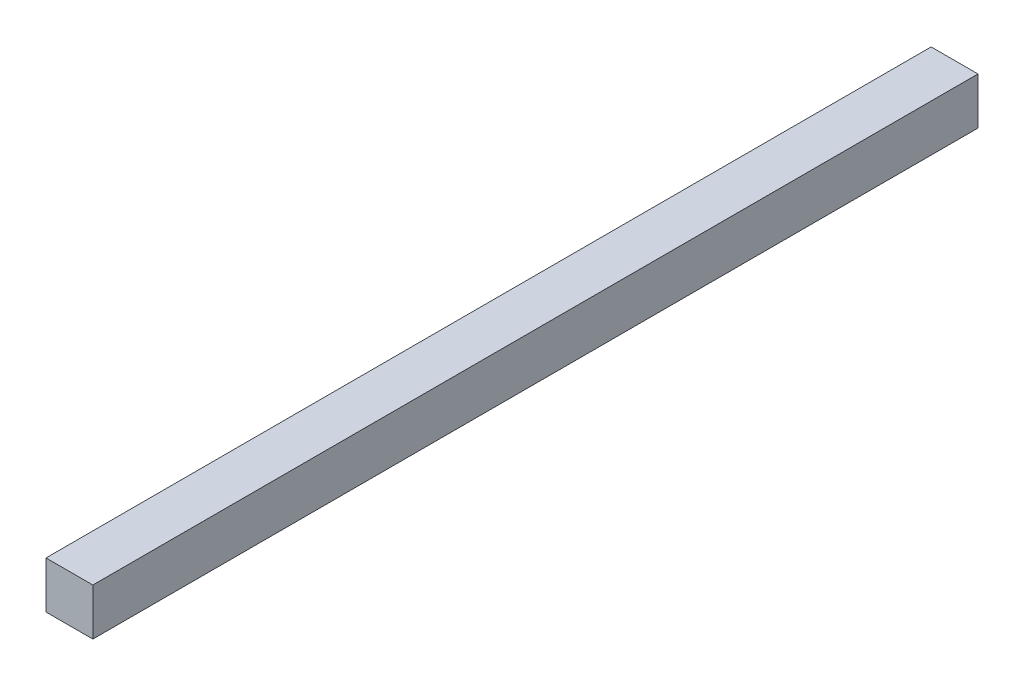
ISO-10303-21;
HEADER;
FILE_DESCRIPTION(('STEP AP214'),'2;1');
FILE_NAME('part.step','',(''),(''),'','','');
FILE_SCHEMA(('AUTOMOTIVE_DESIGN { 1 0 10303 214 1 1 1 1 }'));
ENDSEC;
DATA;
#1=APPLICATION_CONTEXT('core data for automotive mechanical design processes');
#2=APPLICATION_PROTOCOL_DEFINITION('international standard','automotive_design',2000,#1);
#3=PRODUCT_CONTEXT('',#1,'mechanical');
#4=PRODUCT('Part','Part','',(#3));
#5=PRODUCT_RELATED_PRODUCT_CATEGORY('part','',(#4));
#6=PRODUCT_DEFINITION_FORMATION('','',#4);
#7=PRODUCT_DEFINITION_CONTEXT('part definition',#1,'design');
#8=PRODUCT_DEFINITION('design','',#6,#7);
#9=PRODUCT_DEFINITION_SHAPE('','',#8);
#10=(LENGTH_UNIT() NAMED_UNIT(*) SI_UNIT(.MILLI.,.METRE.));
#11=(NAMED_UNIT(*) PLANE_ANGLE_UNIT() SI_UNIT($,.RADIAN.));
#12=(NAMED_UNIT(*) SI_UNIT($,.STERADIAN.) SOLID_ANGLE_UNIT());
#13=UNCERTAINTY_MEASURE_WITH_UNIT(LENGTH_MEASURE(1.E-05),#10,'distance_accuracy_value','');
#14=(GEOMETRIC_REPRESENTATION_CONTEXT(3) GLOBAL_UNCERTAINTY_ASSIGNED_CONTEXT((#13)) GLOBAL_UNIT_ASSIGNED_CONTEXT((#10,
#11,#12)) REPRESENTATION_CONTEXT('',''));
#15=CARTESIAN_POINT('',(0.,0.,0.));
#16=DIRECTION('',(0.,0.,1.));
#17=DIRECTION('',(1.,0.,0.));
#18=AXIS2_PLACEMENT_3D('',#15,#16,#17);
#19=CARTESIAN_POINT('',(0.,0.,-340.));
#20=DIRECTION('',(-1.,0.,0.));
#21=DIRECTION('',(0.,0.,1.));
#22=AXIS2_PLACEMENT_3D('',#19,#20,#21);
#23=PLANE('',#22);
#24=DIRECTION('',(0.,-1.,0.));
#25=VECTOR('',#24,1.);
#26=CARTESIAN_POINT('',(0.,0.,0.));
#27=LINE('',#26,#25);
#28=CARTESIAN_POINT('',(0.,18.,0.));
#29=VERTEX_POINT('',#28);
#30=CARTESIAN_POINT('',(0.,0.,0.));
#31=VERTEX_POINT('',#30);
#32=EDGE_CURVE('E95',#29,#31,#27,.T.);
#33=ORIENTED_EDGE('',*,*,#32,.F.);
#34=DIRECTION('',(0.,0.,1.));
#35=VECTOR('',#34,1.);
#36=CARTESIAN_POINT('',(0.,18.,-340.));
#37=LINE('',#36,#35);
#38=CARTESIAN_POINT('',(0.,18.,-340.));
#39=VERTEX_POINT('',#38);
#40=EDGE_CURVE('E11',#39,#29,#37,.T.);
#41=ORIENTED_EDGE('',*,*,#40,.F.);
#42=DIRECTION('',(0.,-1.,0.));
#43=VECTOR('',#42,1.);
#44=CARTESIAN_POINT('',(0.,0.,-340.));
#45=LINE('',#44,#43);
#46=CARTESIAN_POINT('',(0.,0.,-340.));
#47=VERTEX_POINT('',#46);
#48=EDGE_CURVE('E89',#39,#47,#45,.T.);
#49=ORIENTED_EDGE('',*,*,#48,.T.);
#50=DIRECTION('',(0.,0.,1.));
#51=VECTOR('',#50,1.);
#52=CARTESIAN_POINT('',(0.,0.,-340.));
#53=LINE('',#52,#51);
#54=EDGE_CURVE('E34',#47,#31,#53,.T.);
#55=ORIENTED_EDGE('',*,*,#54,.T.);
#56=EDGE_LOOP('',(#33,#41,#49,#55));
#57=FACE_BOUND('',#56,.T.);
#58=ADVANCED_FACE('F31',(#57),#23,.T.);
#59=CARTESIAN_POINT('',(0.,18.,-340.));
#60=DIRECTION('',(0.,1.,0.));
#61=DIRECTION('',(0.,0.,1.));
#62=AXIS2_PLACEMENT_3D('',#59,#60,#61);
#63=PLANE('',#62);
#64=DIRECTION('',(-1.,0.,0.));
#65=VECTOR('',#64,1.);
#66=CARTESIAN_POINT('',(0.,18.,0.));
#67=LINE('',#66,#65);
#68=CARTESIAN_POINT('',(18.,18.,0.));
#69=VERTEX_POINT('',#68);
#70=EDGE_CURVE('E91',#69,#29,#67,.T.);
#71=ORIENTED_EDGE('',*,*,#70,.F.);
#72=DIRECTION('',(0.,0.,1.));
#73=VECTOR('',#72,1.);
#74=CARTESIAN_POINT('',(18.,18.,-340.));
#75=LINE('',#74,#73);
#76=CARTESIAN_POINT('',(18.,18.,-340.));
#77=VERTEX_POINT('',#76);
#78=EDGE_CURVE('E40',#77,#69,#75,.T.);
#79=ORIENTED_EDGE('',*,*,#78,.F.);
#80=DIRECTION('',(-1.,0.,0.));
#81=VECTOR('',#80,1.);
#82=CARTESIAN_POINT('',(0.,18.,-340.));
#83=LINE('',#82,#81);
#84=EDGE_CURVE('E86',#77,#39,#83,.T.);
#85=ORIENTED_EDGE('',*,*,#84,.T.);
#86=ORIENTED_EDGE('',*,*,#40,.T.);
#87=EDGE_LOOP('',(#71,#79,#85,#86));
#88=FACE_BOUND('',#87,.T.);
#89=ADVANCED_FACE('F105',(#88),#63,.T.);
#90=CARTESIAN_POINT('',(18.,0.,-340.));
#91=DIRECTION('',(1.,0.,0.));
#92=DIRECTION('',(0.,0.,-1.));
#93=AXIS2_PLACEMENT_3D('',#90,#91,#92);
#94=PLANE('',#93);
#95=DIRECTION('',(0.,1.,0.));
#96=VECTOR('',#95,1.);
#97=CARTESIAN_POINT('',(18.,0.,0.));
#98=LINE('',#97,#96);
#99=CARTESIAN_POINT('',(18.,0.,0.));
#100=VERTEX_POINT('',#99);
#101=EDGE_CURVE('E81',#100,#69,#98,.T.);
#102=ORIENTED_EDGE('',*,*,#101,.F.);
#103=DIRECTION('',(0.,0.,1.));
#104=VECTOR('',#103,1.);
#105=CARTESIAN_POINT('',(18.,0.,-340.));
#106=LINE('',#105,#104);
#107=CARTESIAN_POINT('',(18.,0.,-340.));
#108=VERTEX_POINT('',#107);
#109=EDGE_CURVE('E76',#108,#100,#106,.T.);
#110=ORIENTED_EDGE('',*,*,#109,.F.);
#111=DIRECTION('',(0.,1.,0.));
#112=VECTOR('',#111,1.);
#113=CARTESIAN_POINT('',(18.,0.,-340.));
#114=LINE('',#113,#112);
#115=EDGE_CURVE('E79',#108,#77,#114,.T.);
#116=ORIENTED_EDGE('',*,*,#115,.T.);
#117=ORIENTED_EDGE('',*,*,#78,.T.);
#118=EDGE_LOOP('',(#102,#110,#116,#117));
#119=FACE_BOUND('',#118,.T.);
#120=ADVANCED_FACE('F78',(#119),#94,.T.);
#121=CARTESIAN_POINT('',(0.,0.,-340.));
#122=DIRECTION('',(0.,-1.,0.));
#123=DIRECTION('',(0.,0.,-1.));
#124=AXIS2_PLACEMENT_3D('',#121,#122,#123);
#125=PLANE('',#124);
#126=DIRECTION('',(1.,0.,0.));
#127=VECTOR('',#126,1.);
#128=CARTESIAN_POINT('',(0.,0.,0.));
#129=LINE('',#128,#127);
#130=EDGE_CURVE('E98',#31,#100,#129,.T.);
#131=ORIENTED_EDGE('',*,*,#130,.F.);
#132=ORIENTED_EDGE('',*,*,#54,.F.);
#133=DIRECTION('',(1.,0.,0.));
#134=VECTOR('',#133,1.);
#135=CARTESIAN_POINT('',(0.,0.,-340.));
#136=LINE('',#135,#134);
#137=EDGE_CURVE('E85',#47,#108,#136,.T.);
#138=ORIENTED_EDGE('',*,*,#137,.T.);
#139=ORIENTED_EDGE('',*,*,#109,.T.);
#140=EDGE_LOOP('',(#131,#132,#138,#139));
#141=FACE_BOUND('',#140,.T.);
#142=ADVANCED_FACE('F88',(#141),#125,.T.);
#143=CARTESIAN_POINT('',(0.,18.,-340.));
#144=DIRECTION('',(0.,0.,-1.));
#145=DIRECTION('',(-1.,0.,0.));
#146=AXIS2_PLACEMENT_3D('',#143,#144,#145);
#147=PLANE('',#146);
#148=ORIENTED_EDGE('',*,*,#48,.F.);
#149=ORIENTED_EDGE('',*,*,#84,.F.);
#150=ORIENTED_EDGE('',*,*,#115,.F.);
#151=ORIENTED_EDGE('',*,*,#137,.F.);
#152=EDGE_LOOP('',(#148,#149,#150,#151));
#153=FACE_BOUND('',#152,.T.);
#154=ADVANCED_FACE('F84',(#153),#147,.T.);
#155=CARTESIAN_POINT('',(0.,18.,0.));
#156=DIRECTION('',(0.,0.,-1.));
#157=DIRECTION('',(-1.,0.,0.));
#158=AXIS2_PLACEMENT_3D('',#155,#156,#157);
#159=PLANE('',#158);
#160=ORIENTED_EDGE('',*,*,#32,.T.);
#161=ORIENTED_EDGE('',*,*,#130,.T.);
#162=ORIENTED_EDGE('',*,*,#101,.T.);
#163=ORIENTED_EDGE('',*,*,#70,.T.);
#164=EDGE_LOOP('',(#160,#161,#162,#163));
#165=FACE_BOUND('',#164,.T.);
#166=ADVANCED_FACE('F104',(#165),#159,.F.);
#167=CLOSED_SHELL('',(#58,#89,#120,#142,#154,#166));
#168=MANIFOLD_SOLID_BREP('B2',#167);
#169=ADVANCED_BREP_SHAPE_REPRESENTATION('',(#18,#168),#14);
#170=SHAPE_DEFINITION_REPRESENTATION(#9,#169);
ENDSEC;
END-ISO-10303-21;
